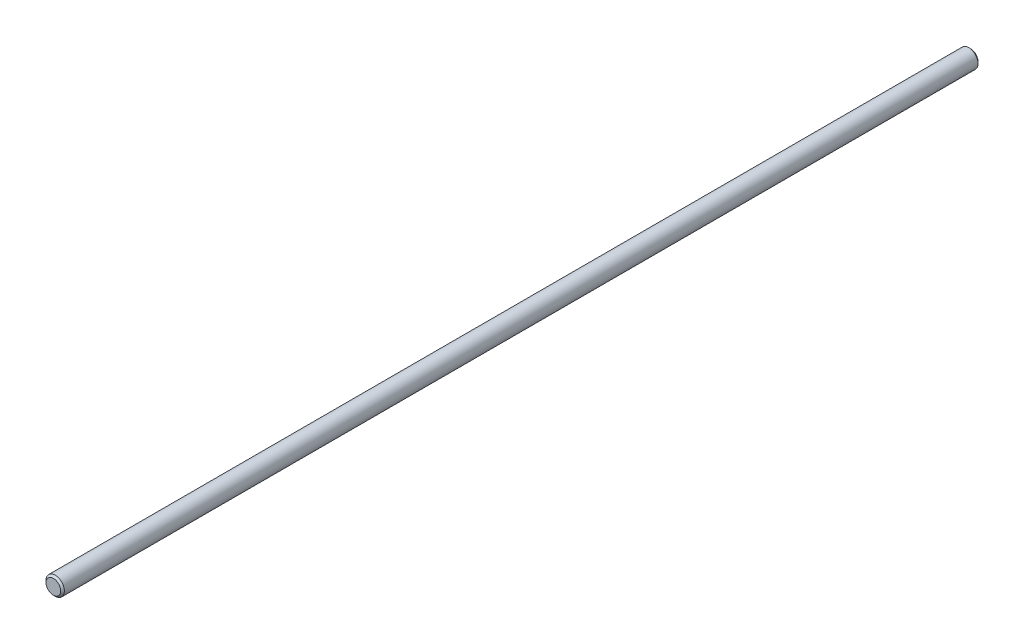
ISO-10303-21;
HEADER;
FILE_DESCRIPTION(('STEP AP214'),'2;1');
FILE_NAME('part.step','',(''),(''),'','','');
FILE_SCHEMA(('AUTOMOTIVE_DESIGN { 1 0 10303 214 1 1 1 1 }'));
ENDSEC;
DATA;
#1=APPLICATION_CONTEXT('core data for automotive mechanical design processes');
#2=APPLICATION_PROTOCOL_DEFINITION('international standard','automotive_design',2000,#1);
#3=PRODUCT_CONTEXT('',#1,'mechanical');
#4=PRODUCT('Part','Part','',(#3));
#5=PRODUCT_RELATED_PRODUCT_CATEGORY('part','',(#4));
#6=PRODUCT_DEFINITION_FORMATION('','',#4);
#7=PRODUCT_DEFINITION_CONTEXT('part definition',#1,'design');
#8=PRODUCT_DEFINITION('design','',#6,#7);
#9=PRODUCT_DEFINITION_SHAPE('','',#8);
#10=(LENGTH_UNIT() NAMED_UNIT(*) SI_UNIT(.MILLI.,.METRE.));
#11=(NAMED_UNIT(*) PLANE_ANGLE_UNIT() SI_UNIT($,.RADIAN.));
#12=(NAMED_UNIT(*) SI_UNIT($,.STERADIAN.) SOLID_ANGLE_UNIT());
#13=UNCERTAINTY_MEASURE_WITH_UNIT(LENGTH_MEASURE(1.E-05),#10,'distance_accuracy_value','');
#14=(GEOMETRIC_REPRESENTATION_CONTEXT(3) GLOBAL_UNCERTAINTY_ASSIGNED_CONTEXT((#13)) GLOBAL_UNIT_ASSIGNED_CONTEXT((#10,
#11,#12)) REPRESENTATION_CONTEXT('',''));
#15=CARTESIAN_POINT('',(0.,0.,0.));
#16=DIRECTION('',(0.,0.,1.));
#17=DIRECTION('',(1.,0.,0.));
#18=AXIS2_PLACEMENT_3D('',#15,#16,#17);
#19=CARTESIAN_POINT('',(0.,0.,1000.));
#20=DIRECTION('',(0.,0.,-1.));
#21=DIRECTION('',(-1.,0.,0.));
#22=AXIS2_PLACEMENT_3D('',#19,#20,#21);
#23=CYLINDRICAL_SURFACE('',#22,10.);
#24=CARTESIAN_POINT('',(0.,0.,2.00000000000022));
#25=DIRECTION('',(0.,0.,1.));
#26=DIRECTION('',(1.,0.,0.));
#27=AXIS2_PLACEMENT_3D('',#24,#25,#26);
#28=CIRCLE('',#27,10.);
#29=CARTESIAN_POINT('',(10.,0.,2.00000000000022));
#30=VERTEX_POINT('',#29);
#31=EDGE_CURVE('E41',#30,#30,#28,.T.);
#32=ORIENTED_EDGE('',*,*,#31,.T.);
#33=EDGE_LOOP('',(#32));
#34=FACE_BOUND('',#33,.T.);
#35=CARTESIAN_POINT('',(0.,0.,998.));
#36=DIRECTION('',(0.,0.,1.));
#37=DIRECTION('',(1.,0.,0.));
#38=AXIS2_PLACEMENT_3D('',#35,#36,#37);
#39=CIRCLE('',#38,10.);
#40=CARTESIAN_POINT('',(10.,0.,998.));
#41=VERTEX_POINT('',#40);
#42=EDGE_CURVE('E45',#41,#41,#39,.F.);
#43=ORIENTED_EDGE('',*,*,#42,.T.);
#44=EDGE_LOOP('',(#43));
#45=FACE_BOUND('',#44,.T.);
#46=ADVANCED_FACE('F30',(#34,#45),#23,.T.);
#47=CARTESIAN_POINT('',(0.,0.,1000.));
#48=DIRECTION('',(0.,0.,1.));
#49=DIRECTION('',(1.,0.,0.));
#50=AXIS2_PLACEMENT_3D('',#47,#48,#49);
#51=PLANE('',#50);
#52=CARTESIAN_POINT('',(0.,0.,1000.));
#53=DIRECTION('',(0.,0.,1.));
#54=DIRECTION('',(1.,0.,0.));
#55=AXIS2_PLACEMENT_3D('',#52,#53,#54);
#56=CIRCLE('',#55,8.00000000000001);
#57=CARTESIAN_POINT('',(8.00000000000001,0.,1000.));
#58=VERTEX_POINT('',#57);
#59=EDGE_CURVE('E10',#58,#58,#56,.T.);
#60=ORIENTED_EDGE('',*,*,#59,.T.);
#61=EDGE_LOOP('',(#60));
#62=FACE_BOUND('',#61,.T.);
#63=ADVANCED_FACE('F61',(#62),#51,.T.);
#64=CARTESIAN_POINT('',(0.,0.,0.));
#65=DIRECTION('',(0.,0.,1.));
#66=DIRECTION('',(1.,0.,0.));
#67=AXIS2_PLACEMENT_3D('',#64,#65,#66);
#68=PLANE('',#67);
#69=CARTESIAN_POINT('',(0.,0.,0.));
#70=DIRECTION('',(0.,0.,1.));
#71=DIRECTION('',(1.,0.,0.));
#72=AXIS2_PLACEMENT_3D('',#69,#70,#71);
#73=CIRCLE('',#72,7.99999999999979);
#74=CARTESIAN_POINT('',(7.99999999999979,0.,0.));
#75=VERTEX_POINT('',#74);
#76=EDGE_CURVE('E37',#75,#75,#73,.F.);
#77=ORIENTED_EDGE('',*,*,#76,.T.);
#78=EDGE_LOOP('',(#77));
#79=FACE_BOUND('',#78,.T.);
#80=ADVANCED_FACE('F58',(#79),#68,.F.);
#81=CARTESIAN_POINT('',(0.,0.,2.00000000000022));
#82=DIRECTION('',(0.,0.,1.));
#83=DIRECTION('',(1.,0.,0.));
#84=AXIS2_PLACEMENT_3D('',#81,#82,#83);
#85=CONICAL_SURFACE('',#84,10.,0.785398163397446);
#86=ORIENTED_EDGE('',*,*,#76,.F.);
#87=EDGE_LOOP('',(#86));
#88=FACE_BOUND('',#87,.T.);
#89=ORIENTED_EDGE('',*,*,#31,.F.);
#90=EDGE_LOOP('',(#89));
#91=FACE_BOUND('',#90,.T.);
#92=ADVANCED_FACE('F54',(#88,#91),#85,.T.);
#93=CARTESIAN_POINT('',(0.,0.,1000.));
#94=DIRECTION('',(0.,0.,-1.));
#95=DIRECTION('',(-1.,0.,0.));
#96=AXIS2_PLACEMENT_3D('',#93,#94,#95);
#97=CONICAL_SURFACE('',#96,8.00000000000001,0.785398163397474);
#98=ORIENTED_EDGE('',*,*,#42,.F.);
#99=EDGE_LOOP('',(#98));
#100=FACE_BOUND('',#99,.T.);
#101=ORIENTED_EDGE('',*,*,#59,.F.);
#102=EDGE_LOOP('',(#101));
#103=FACE_BOUND('',#102,.T.);
#104=ADVANCED_FACE('F32',(#100,#103),#97,.T.);
#105=CLOSED_SHELL('',(#46,#63,#80,#92,#104));
#106=MANIFOLD_SOLID_BREP('B2',#105);
#107=ADVANCED_BREP_SHAPE_REPRESENTATION('',(#18,#106),#14);
#108=SHAPE_DEFINITION_REPRESENTATION(#9,#107);
ENDSEC;
END-ISO-10303-21;
